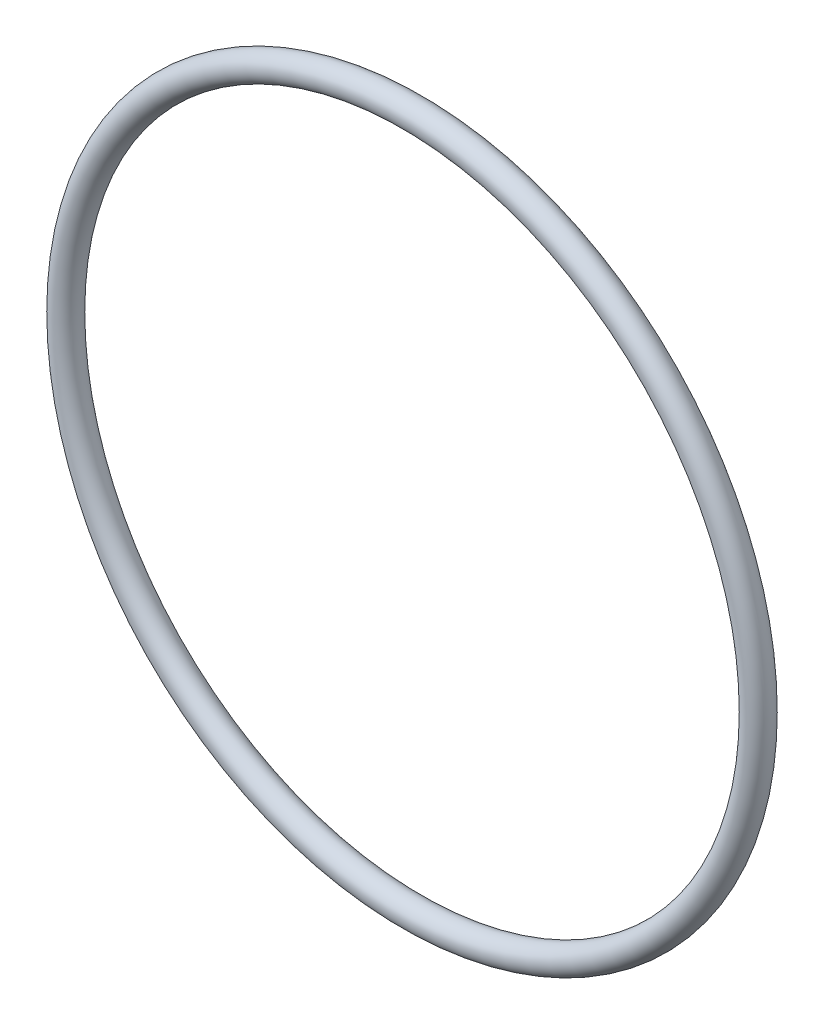
ISO-10303-21;
HEADER;
FILE_DESCRIPTION(('STEP AP214'),'2;1');
FILE_NAME('part.step','',(''),(''),'','','');
FILE_SCHEMA(('AUTOMOTIVE_DESIGN { 1 0 10303 214 1 1 1 1 }'));
ENDSEC;
DATA;
#1=APPLICATION_CONTEXT('core data for automotive mechanical design processes');
#2=APPLICATION_PROTOCOL_DEFINITION('international standard','automotive_design',2000,#1);
#3=PRODUCT_CONTEXT('',#1,'mechanical');
#4=PRODUCT('Part','Part','',(#3));
#5=PRODUCT_RELATED_PRODUCT_CATEGORY('part','',(#4));
#6=PRODUCT_DEFINITION_FORMATION('','',#4);
#7=PRODUCT_DEFINITION_CONTEXT('part definition',#1,'design');
#8=PRODUCT_DEFINITION('design','',#6,#7);
#9=PRODUCT_DEFINITION_SHAPE('','',#8);
#10=(LENGTH_UNIT() NAMED_UNIT(*) SI_UNIT(.MILLI.,.METRE.));
#11=(NAMED_UNIT(*) PLANE_ANGLE_UNIT() SI_UNIT($,.RADIAN.));
#12=(NAMED_UNIT(*) SI_UNIT($,.STERADIAN.) SOLID_ANGLE_UNIT());
#13=UNCERTAINTY_MEASURE_WITH_UNIT(LENGTH_MEASURE(1.E-05),#10,'distance_accuracy_value','');
#14=(GEOMETRIC_REPRESENTATION_CONTEXT(3) GLOBAL_UNCERTAINTY_ASSIGNED_CONTEXT((#13)) GLOBAL_UNIT_ASSIGNED_CONTEXT((#10,
#11,#12)) REPRESENTATION_CONTEXT('',''));
#15=CARTESIAN_POINT('',(0.,0.,0.));
#16=DIRECTION('',(0.,0.,1.));
#17=DIRECTION('',(1.,0.,0.));
#18=AXIS2_PLACEMENT_3D('',#15,#16,#17);
#19=CARTESIAN_POINT('',(0.,0.,0.));
#20=DIRECTION('',(0.,0.,1.));
#21=DIRECTION('',(1.,0.,0.));
#22=AXIS2_PLACEMENT_3D('',#19,#20,#21);
#23=TOROIDAL_SURFACE('',#22,33.6931,1.3081);
#24=CARTESIAN_POINT('',(35.0012,0.,0.));
#25=VERTEX_POINT('',#24);
#26=VERTEX_LOOP('',#25);
#27=FACE_BOUND('',#26,.T.);
#28=ADVANCED_FACE('F32',(#27),#23,.T.);
#29=CLOSED_SHELL('',(#28));
#30=MANIFOLD_SOLID_BREP('B2',#29);
#31=ADVANCED_BREP_SHAPE_REPRESENTATION('',(#18,#30),#14);
#32=SHAPE_DEFINITION_REPRESENTATION(#9,#31);
ENDSEC;
END-ISO-10303-21;
